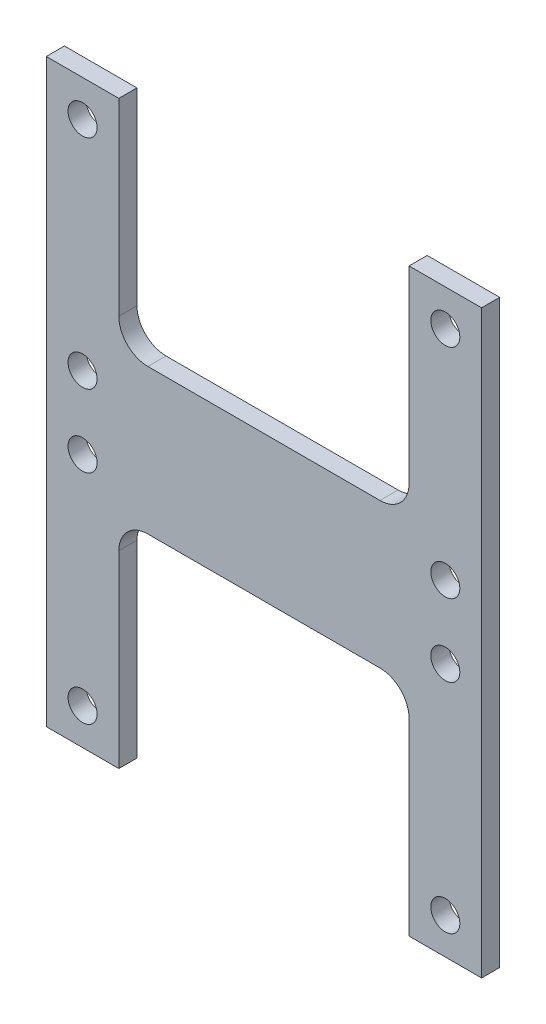
ISO-10303-21;
HEADER;
FILE_DESCRIPTION(('STEP AP214'),'2;1');
FILE_NAME('part.step','',(''),(''),'','','');
FILE_SCHEMA(('AUTOMOTIVE_DESIGN { 1 0 10303 214 1 1 1 1 }'));
ENDSEC;
DATA;
#1=APPLICATION_CONTEXT('core data for automotive mechanical design processes');
#2=APPLICATION_PROTOCOL_DEFINITION('international standard','automotive_design',2000,#1);
#3=PRODUCT_CONTEXT('',#1,'mechanical');
#4=PRODUCT('Part','Part','',(#3));
#5=PRODUCT_RELATED_PRODUCT_CATEGORY('part','',(#4));
#6=PRODUCT_DEFINITION_FORMATION('','',#4);
#7=PRODUCT_DEFINITION_CONTEXT('part definition',#1,'design');
#8=PRODUCT_DEFINITION('design','',#6,#7);
#9=PRODUCT_DEFINITION_SHAPE('','',#8);
#10=(LENGTH_UNIT() NAMED_UNIT(*) SI_UNIT(.MILLI.,.METRE.));
#11=(NAMED_UNIT(*) PLANE_ANGLE_UNIT() SI_UNIT($,.RADIAN.));
#12=(NAMED_UNIT(*) SI_UNIT($,.STERADIAN.) SOLID_ANGLE_UNIT());
#13=UNCERTAINTY_MEASURE_WITH_UNIT(LENGTH_MEASURE(1.E-05),#10,'distance_accuracy_value','');
#14=(GEOMETRIC_REPRESENTATION_CONTEXT(3) GLOBAL_UNCERTAINTY_ASSIGNED_CONTEXT((#13)) GLOBAL_UNIT_ASSIGNED_CONTEXT((#10,
#11,#12)) REPRESENTATION_CONTEXT('',''));
#15=CARTESIAN_POINT('',(0.,0.,0.));
#16=DIRECTION('',(0.,0.,1.));
#17=DIRECTION('',(1.,0.,0.));
#18=AXIS2_PLACEMENT_3D('',#15,#16,#17);
#19=CARTESIAN_POINT('',(0.,50.8,3.175));
#20=DIRECTION('',(0.,1.,0.));
#21=DIRECTION('',(0.,0.,1.));
#22=AXIS2_PLACEMENT_3D('',#19,#20,#21);
#23=PLANE('',#22);
#24=DIRECTION('',(1.,0.,0.));
#25=VECTOR('',#24,1.);
#26=CARTESIAN_POINT('',(0.,50.8,0.));
#27=LINE('',#26,#25);
#28=CARTESIAN_POINT('',(25.4,50.8,0.));
#29=VERTEX_POINT('',#28);
#30=CARTESIAN_POINT('',(38.1,50.8,0.));
#31=VERTEX_POINT('',#30);
#32=EDGE_CURVE('E176',#29,#31,#27,.T.);
#33=ORIENTED_EDGE('',*,*,#32,.F.);
#34=DIRECTION('',(0.,0.,-1.));
#35=VECTOR('',#34,1.);
#36=CARTESIAN_POINT('',(25.4,50.8,3.175));
#37=LINE('',#36,#35);
#38=CARTESIAN_POINT('',(25.4,50.8,3.175));
#39=VERTEX_POINT('',#38);
#40=EDGE_CURVE('E162',#39,#29,#37,.T.);
#41=ORIENTED_EDGE('',*,*,#40,.F.);
#42=DIRECTION('',(1.,0.,0.));
#43=VECTOR('',#42,1.);
#44=CARTESIAN_POINT('',(0.,50.8,3.175));
#45=LINE('',#44,#43);
#46=CARTESIAN_POINT('',(38.1,50.8,3.175));
#47=VERTEX_POINT('',#46);
#48=EDGE_CURVE('E170',#39,#47,#45,.T.);
#49=ORIENTED_EDGE('',*,*,#48,.T.);
#50=DIRECTION('',(0.,0.,-1.));
#51=VECTOR('',#50,1.);
#52=CARTESIAN_POINT('',(38.1,50.8,3.175));
#53=LINE('',#52,#51);
#54=EDGE_CURVE('E227',#47,#31,#53,.T.);
#55=ORIENTED_EDGE('',*,*,#54,.T.);
#56=EDGE_LOOP('',(#33,#41,#49,#55));
#57=FACE_BOUND('',#56,.T.);
#58=ADVANCED_FACE('F44',(#57),#23,.T.);
#59=CARTESIAN_POINT('',(25.4,0.,3.175));
#60=DIRECTION('',(-1.,0.,0.));
#61=DIRECTION('',(0.,0.,1.));
#62=AXIS2_PLACEMENT_3D('',#59,#60,#61);
#63=PLANE('',#62);
#64=DIRECTION('',(0.,1.,0.));
#65=VECTOR('',#64,1.);
#66=CARTESIAN_POINT('',(25.4,0.,0.));
#67=LINE('',#66,#65);
#68=CARTESIAN_POINT('',(25.4,17.78,0.));
#69=VERTEX_POINT('',#68);
#70=EDGE_CURVE('E230',#69,#29,#67,.T.);
#71=ORIENTED_EDGE('',*,*,#70,.F.);
#72=DIRECTION('',(0.,0.,-1.));
#73=VECTOR('',#72,1.);
#74=CARTESIAN_POINT('',(25.4,17.78,3.175));
#75=LINE('',#74,#73);
#76=CARTESIAN_POINT('',(25.4,17.78,3.175));
#77=VERTEX_POINT('',#76);
#78=EDGE_CURVE('E165',#69,#77,#75,.F.);
#79=ORIENTED_EDGE('',*,*,#78,.T.);
#80=DIRECTION('',(0.,1.,0.));
#81=VECTOR('',#80,1.);
#82=CARTESIAN_POINT('',(25.4,0.,3.175));
#83=LINE('',#82,#81);
#84=EDGE_CURVE('E158',#77,#39,#83,.T.);
#85=ORIENTED_EDGE('',*,*,#84,.T.);
#86=ORIENTED_EDGE('',*,*,#40,.T.);
#87=EDGE_LOOP('',(#71,#79,#85,#86));
#88=FACE_BOUND('',#87,.T.);
#89=ADVANCED_FACE('F161',(#88),#63,.T.);
#90=CARTESIAN_POINT('',(0.,12.7,3.175));
#91=DIRECTION('',(0.,1.,0.));
#92=DIRECTION('',(0.,0.,1.));
#93=AXIS2_PLACEMENT_3D('',#90,#91,#92);
#94=PLANE('',#93);
#95=DIRECTION('',(1.,0.,0.));
#96=VECTOR('',#95,1.);
#97=CARTESIAN_POINT('',(0.,12.7,3.175));
#98=LINE('',#97,#96);
#99=CARTESIAN_POINT('',(-20.32,12.7,3.175));
#100=VERTEX_POINT('',#99);
#101=CARTESIAN_POINT('',(20.32,12.7,3.175));
#102=VERTEX_POINT('',#101);
#103=EDGE_CURVE('E169',#100,#102,#98,.T.);
#104=ORIENTED_EDGE('',*,*,#103,.T.);
#105=DIRECTION('',(0.,0.,-1.));
#106=VECTOR('',#105,1.);
#107=CARTESIAN_POINT('',(20.32,12.7,0.));
#108=LINE('',#107,#106);
#109=CARTESIAN_POINT('',(20.32,12.7,0.));
#110=VERTEX_POINT('',#109);
#111=EDGE_CURVE('E304',#102,#110,#108,.T.);
#112=ORIENTED_EDGE('',*,*,#111,.T.);
#113=DIRECTION('',(1.,0.,0.));
#114=VECTOR('',#113,1.);
#115=CARTESIAN_POINT('',(0.,12.7,0.));
#116=LINE('',#115,#114);
#117=CARTESIAN_POINT('',(-20.32,12.7,0.));
#118=VERTEX_POINT('',#117);
#119=EDGE_CURVE('E234',#118,#110,#116,.T.);
#120=ORIENTED_EDGE('',*,*,#119,.F.);
#121=DIRECTION('',(0.,0.,-1.));
#122=VECTOR('',#121,1.);
#123=CARTESIAN_POINT('',(-20.32,12.7,3.175));
#124=LINE('',#123,#122);
#125=EDGE_CURVE('E301',#118,#100,#124,.F.);
#126=ORIENTED_EDGE('',*,*,#125,.T.);
#127=EDGE_LOOP('',(#104,#112,#120,#126));
#128=FACE_BOUND('',#127,.T.);
#129=ADVANCED_FACE('F336',(#128),#94,.T.);
#130=CARTESIAN_POINT('',(-25.4,0.,3.175));
#131=DIRECTION('',(1.,0.,0.));
#132=DIRECTION('',(0.,1.,0.));
#133=AXIS2_PLACEMENT_3D('',#130,#131,#132);
#134=PLANE('',#133);
#135=DIRECTION('',(0.,-1.,0.));
#136=VECTOR('',#135,1.);
#137=CARTESIAN_POINT('',(-25.4,0.,3.175));
#138=LINE('',#137,#136);
#139=CARTESIAN_POINT('',(-25.4,50.8,3.175));
#140=VERTEX_POINT('',#139);
#141=CARTESIAN_POINT('',(-25.4,17.78,3.175));
#142=VERTEX_POINT('',#141);
#143=EDGE_CURVE('E198',#140,#142,#138,.T.);
#144=ORIENTED_EDGE('',*,*,#143,.T.);
#145=DIRECTION('',(0.,0.,-1.));
#146=VECTOR('',#145,1.);
#147=CARTESIAN_POINT('',(-25.4,17.78,0.));
#148=LINE('',#147,#146);
#149=CARTESIAN_POINT('',(-25.4,17.78,0.));
#150=VERTEX_POINT('',#149);
#151=EDGE_CURVE('E310',#142,#150,#148,.T.);
#152=ORIENTED_EDGE('',*,*,#151,.T.);
#153=DIRECTION('',(0.,-1.,0.));
#154=VECTOR('',#153,1.);
#155=CARTESIAN_POINT('',(-25.4,0.,0.));
#156=LINE('',#155,#154);
#157=CARTESIAN_POINT('',(-25.4,50.8,0.));
#158=VERTEX_POINT('',#157);
#159=EDGE_CURVE('E238',#158,#150,#156,.T.);
#160=ORIENTED_EDGE('',*,*,#159,.F.);
#161=DIRECTION('',(0.,0.,-1.));
#162=VECTOR('',#161,1.);
#163=CARTESIAN_POINT('',(-25.4,50.8,3.175));
#164=LINE('',#163,#162);
#165=EDGE_CURVE('E179',#140,#158,#164,.T.);
#166=ORIENTED_EDGE('',*,*,#165,.F.);
#167=EDGE_LOOP('',(#144,#152,#160,#166));
#168=FACE_BOUND('',#167,.T.);
#169=ADVANCED_FACE('F339',(#168),#134,.T.);
#170=CARTESIAN_POINT('',(0.,50.8,3.175));
#171=DIRECTION('',(0.,1.,0.));
#172=DIRECTION('',(0.,0.,1.));
#173=AXIS2_PLACEMENT_3D('',#170,#171,#172);
#174=PLANE('',#173);
#175=DIRECTION('',(1.,0.,0.));
#176=VECTOR('',#175,1.);
#177=CARTESIAN_POINT('',(0.,50.8,0.));
#178=LINE('',#177,#176);
#179=CARTESIAN_POINT('',(-38.1,50.8,0.));
#180=VERTEX_POINT('',#179);
#181=EDGE_CURVE('E242',#180,#158,#178,.T.);
#182=ORIENTED_EDGE('',*,*,#181,.F.);
#183=DIRECTION('',(0.,0.,-1.));
#184=VECTOR('',#183,1.);
#185=CARTESIAN_POINT('',(-38.1,50.8,3.175));
#186=LINE('',#185,#184);
#187=CARTESIAN_POINT('',(-38.1,50.8,3.175));
#188=VERTEX_POINT('',#187);
#189=EDGE_CURVE('E283',#188,#180,#186,.T.);
#190=ORIENTED_EDGE('',*,*,#189,.F.);
#191=DIRECTION('',(1.,0.,0.));
#192=VECTOR('',#191,1.);
#193=CARTESIAN_POINT('',(0.,50.8,3.175));
#194=LINE('',#193,#192);
#195=EDGE_CURVE('E201',#188,#140,#194,.T.);
#196=ORIENTED_EDGE('',*,*,#195,.T.);
#197=ORIENTED_EDGE('',*,*,#165,.T.);
#198=EDGE_LOOP('',(#182,#190,#196,#197));
#199=FACE_BOUND('',#198,.T.);
#200=ADVANCED_FACE('F343',(#199),#174,.T.);
#201=CARTESIAN_POINT('',(-38.1,0.,3.175));
#202=DIRECTION('',(1.,0.,0.));
#203=DIRECTION('',(0.,1.,0.));
#204=AXIS2_PLACEMENT_3D('',#201,#202,#203);
#205=PLANE('',#204);
#206=DIRECTION('',(0.,-1.,0.));
#207=VECTOR('',#206,1.);
#208=CARTESIAN_POINT('',(-38.1,0.,0.));
#209=LINE('',#208,#207);
#210=CARTESIAN_POINT('',(-38.1,-50.8,0.));
#211=VERTEX_POINT('',#210);
#212=EDGE_CURVE('E246',#180,#211,#209,.T.);
#213=ORIENTED_EDGE('',*,*,#212,.T.);
#214=DIRECTION('',(0.,0.,-1.));
#215=VECTOR('',#214,1.);
#216=CARTESIAN_POINT('',(-38.1,-50.8,3.175));
#217=LINE('',#216,#215);
#218=CARTESIAN_POINT('',(-38.1,-50.8,3.175));
#219=VERTEX_POINT('',#218);
#220=EDGE_CURVE('E279',#219,#211,#217,.T.);
#221=ORIENTED_EDGE('',*,*,#220,.F.);
#222=DIRECTION('',(0.,-1.,0.));
#223=VECTOR('',#222,1.);
#224=CARTESIAN_POINT('',(-38.1,0.,3.175));
#225=LINE('',#224,#223);
#226=EDGE_CURVE('E205',#188,#219,#225,.T.);
#227=ORIENTED_EDGE('',*,*,#226,.F.);
#228=ORIENTED_EDGE('',*,*,#189,.T.);
#229=EDGE_LOOP('',(#213,#221,#227,#228));
#230=FACE_BOUND('',#229,.T.);
#231=ADVANCED_FACE('F348',(#230),#205,.F.);
#232=CARTESIAN_POINT('',(0.,-50.8,3.175));
#233=DIRECTION('',(0.,1.,0.));
#234=DIRECTION('',(0.,0.,1.));
#235=AXIS2_PLACEMENT_3D('',#232,#233,#234);
#236=PLANE('',#235);
#237=DIRECTION('',(1.,0.,0.));
#238=VECTOR('',#237,1.);
#239=CARTESIAN_POINT('',(0.,-50.8,0.));
#240=LINE('',#239,#238);
#241=CARTESIAN_POINT('',(-25.4,-50.8,0.));
#242=VERTEX_POINT('',#241);
#243=EDGE_CURVE('E249',#211,#242,#240,.T.);
#244=ORIENTED_EDGE('',*,*,#243,.T.);
#245=DIRECTION('',(0.,0.,-1.));
#246=VECTOR('',#245,1.);
#247=CARTESIAN_POINT('',(-25.4,-50.8,3.175));
#248=LINE('',#247,#246);
#249=CARTESIAN_POINT('',(-25.4,-50.8,3.175));
#250=VERTEX_POINT('',#249);
#251=EDGE_CURVE('E275',#250,#242,#248,.T.);
#252=ORIENTED_EDGE('',*,*,#251,.F.);
#253=DIRECTION('',(1.,0.,0.));
#254=VECTOR('',#253,1.);
#255=CARTESIAN_POINT('',(0.,-50.8,3.175));
#256=LINE('',#255,#254);
#257=EDGE_CURVE('E208',#219,#250,#256,.T.);
#258=ORIENTED_EDGE('',*,*,#257,.F.);
#259=ORIENTED_EDGE('',*,*,#220,.T.);
#260=EDGE_LOOP('',(#244,#252,#258,#259));
#261=FACE_BOUND('',#260,.T.);
#262=ADVANCED_FACE('F354',(#261),#236,.F.);
#263=CARTESIAN_POINT('',(-25.4,0.,3.175));
#264=DIRECTION('',(-1.,0.,0.));
#265=DIRECTION('',(0.,0.,1.));
#266=AXIS2_PLACEMENT_3D('',#263,#264,#265);
#267=PLANE('',#266);
#268=DIRECTION('',(0.,1.,0.));
#269=VECTOR('',#268,1.);
#270=CARTESIAN_POINT('',(-25.4,0.,0.));
#271=LINE('',#270,#269);
#272=CARTESIAN_POINT('',(-25.4,-17.7800000000001,0.));
#273=VERTEX_POINT('',#272);
#274=EDGE_CURVE('E252',#242,#273,#271,.T.);
#275=ORIENTED_EDGE('',*,*,#274,.T.);
#276=DIRECTION('',(0.,0.,-1.));
#277=VECTOR('',#276,1.);
#278=CARTESIAN_POINT('',(-25.4,-17.7800000000001,3.175));
#279=LINE('',#278,#277);
#280=CARTESIAN_POINT('',(-25.4,-17.7800000000001,3.175));
#281=VERTEX_POINT('',#280);
#282=EDGE_CURVE('E294',#273,#281,#279,.F.);
#283=ORIENTED_EDGE('',*,*,#282,.T.);
#284=DIRECTION('',(0.,1.,0.));
#285=VECTOR('',#284,1.);
#286=CARTESIAN_POINT('',(-25.4,0.,3.175));
#287=LINE('',#286,#285);
#288=EDGE_CURVE('E211',#250,#281,#287,.T.);
#289=ORIENTED_EDGE('',*,*,#288,.F.);
#290=ORIENTED_EDGE('',*,*,#251,.T.);
#291=EDGE_LOOP('',(#275,#283,#289,#290));
#292=FACE_BOUND('',#291,.T.);
#293=ADVANCED_FACE('F358',(#292),#267,.F.);
#294=CARTESIAN_POINT('',(0.,-12.7000000000001,3.175));
#295=DIRECTION('',(0.,1.,0.));
#296=DIRECTION('',(0.,0.,1.));
#297=AXIS2_PLACEMENT_3D('',#294,#295,#296);
#298=PLANE('',#297);
#299=DIRECTION('',(1.,0.,0.));
#300=VECTOR('',#299,1.);
#301=CARTESIAN_POINT('',(0.,-12.7000000000001,3.175));
#302=LINE('',#301,#300);
#303=CARTESIAN_POINT('',(-20.32,-12.7000000000001,3.175));
#304=VERTEX_POINT('',#303);
#305=CARTESIAN_POINT('',(20.32,-12.7000000000001,3.175));
#306=VERTEX_POINT('',#305);
#307=EDGE_CURVE('E215',#304,#306,#302,.T.);
#308=ORIENTED_EDGE('',*,*,#307,.F.);
#309=DIRECTION('',(0.,0.,-1.));
#310=VECTOR('',#309,1.);
#311=CARTESIAN_POINT('',(-20.32,-12.7000000000001,0.));
#312=LINE('',#311,#310);
#313=CARTESIAN_POINT('',(-20.32,-12.7000000000001,0.));
#314=VERTEX_POINT('',#313);
#315=EDGE_CURVE('E290',#304,#314,#312,.T.);
#316=ORIENTED_EDGE('',*,*,#315,.T.);
#317=DIRECTION('',(1.,0.,0.));
#318=VECTOR('',#317,1.);
#319=CARTESIAN_POINT('',(0.,-12.7000000000001,0.));
#320=LINE('',#319,#318);
#321=CARTESIAN_POINT('',(20.32,-12.7000000000001,0.));
#322=VERTEX_POINT('',#321);
#323=EDGE_CURVE('E256',#314,#322,#320,.T.);
#324=ORIENTED_EDGE('',*,*,#323,.T.);
#325=DIRECTION('',(0.,0.,-1.));
#326=VECTOR('',#325,1.);
#327=CARTESIAN_POINT('',(20.32,-12.7000000000001,3.175));
#328=LINE('',#327,#326);
#329=EDGE_CURVE('E178',#322,#306,#328,.F.);
#330=ORIENTED_EDGE('',*,*,#329,.T.);
#331=EDGE_LOOP('',(#308,#316,#324,#330));
#332=FACE_BOUND('',#331,.T.);
#333=ADVANCED_FACE('F366',(#332),#298,.F.);
#334=CARTESIAN_POINT('',(25.4,0.,3.175));
#335=DIRECTION('',(1.,0.,0.));
#336=DIRECTION('',(0.,1.,0.));
#337=AXIS2_PLACEMENT_3D('',#334,#335,#336);
#338=PLANE('',#337);
#339=DIRECTION('',(0.,-1.,0.));
#340=VECTOR('',#339,1.);
#341=CARTESIAN_POINT('',(25.4,0.,3.175));
#342=LINE('',#341,#340);
#343=CARTESIAN_POINT('',(25.4,-17.7800000000001,3.175));
#344=VERTEX_POINT('',#343);
#345=CARTESIAN_POINT('',(25.4,-50.8,3.175));
#346=VERTEX_POINT('',#345);
#347=EDGE_CURVE('E219',#344,#346,#342,.T.);
#348=ORIENTED_EDGE('',*,*,#347,.F.);
#349=DIRECTION('',(0.,0.,-1.));
#350=VECTOR('',#349,1.);
#351=CARTESIAN_POINT('',(25.4,-17.7800000000001,0.));
#352=LINE('',#351,#350);
#353=CARTESIAN_POINT('',(25.4,-17.7800000000001,0.));
#354=VERTEX_POINT('',#353);
#355=EDGE_CURVE('E297',#344,#354,#352,.T.);
#356=ORIENTED_EDGE('',*,*,#355,.T.);
#357=DIRECTION('',(0.,-1.,0.));
#358=VECTOR('',#357,1.);
#359=CARTESIAN_POINT('',(25.4,0.,0.));
#360=LINE('',#359,#358);
#361=CARTESIAN_POINT('',(25.4,-50.8,0.));
#362=VERTEX_POINT('',#361);
#363=EDGE_CURVE('E260',#354,#362,#360,.T.);
#364=ORIENTED_EDGE('',*,*,#363,.T.);
#365=DIRECTION('',(0.,0.,-1.));
#366=VECTOR('',#365,1.);
#367=CARTESIAN_POINT('',(25.4,-50.8,3.175));
#368=LINE('',#367,#366);
#369=EDGE_CURVE('E271',#346,#362,#368,.T.);
#370=ORIENTED_EDGE('',*,*,#369,.F.);
#371=EDGE_LOOP('',(#348,#356,#364,#370));
#372=FACE_BOUND('',#371,.T.);
#373=ADVANCED_FACE('F375',(#372),#338,.F.);
#374=CARTESIAN_POINT('',(0.,-50.8,3.175));
#375=DIRECTION('',(0.,1.,0.));
#376=DIRECTION('',(0.,0.,1.));
#377=AXIS2_PLACEMENT_3D('',#374,#375,#376);
#378=PLANE('',#377);
#379=DIRECTION('',(1.,0.,0.));
#380=VECTOR('',#379,1.);
#381=CARTESIAN_POINT('',(0.,-50.8,0.));
#382=LINE('',#381,#380);
#383=CARTESIAN_POINT('',(38.1,-50.8,0.));
#384=VERTEX_POINT('',#383);
#385=EDGE_CURVE('E189',#362,#384,#382,.T.);
#386=ORIENTED_EDGE('',*,*,#385,.T.);
#387=DIRECTION('',(0.,0.,-1.));
#388=VECTOR('',#387,1.);
#389=CARTESIAN_POINT('',(38.1,-50.8,3.175));
#390=LINE('',#389,#388);
#391=CARTESIAN_POINT('',(38.1,-50.8,3.175));
#392=VERTEX_POINT('',#391);
#393=EDGE_CURVE('E268',#392,#384,#390,.T.);
#394=ORIENTED_EDGE('',*,*,#393,.F.);
#395=DIRECTION('',(1.,0.,0.));
#396=VECTOR('',#395,1.);
#397=CARTESIAN_POINT('',(0.,-50.8,3.175));
#398=LINE('',#397,#396);
#399=EDGE_CURVE('E222',#346,#392,#398,.T.);
#400=ORIENTED_EDGE('',*,*,#399,.F.);
#401=ORIENTED_EDGE('',*,*,#369,.T.);
#402=EDGE_LOOP('',(#386,#394,#400,#401));
#403=FACE_BOUND('',#402,.T.);
#404=ADVANCED_FACE('F381',(#403),#378,.F.);
#405=CARTESIAN_POINT('',(38.1,0.,3.175));
#406=DIRECTION('',(1.,0.,0.));
#407=DIRECTION('',(0.,1.,0.));
#408=AXIS2_PLACEMENT_3D('',#405,#406,#407);
#409=PLANE('',#408);
#410=DIRECTION('',(0.,-1.,0.));
#411=VECTOR('',#410,1.);
#412=CARTESIAN_POINT('',(38.1,0.,0.));
#413=LINE('',#412,#411);
#414=EDGE_CURVE('E185',#31,#384,#413,.T.);
#415=ORIENTED_EDGE('',*,*,#414,.F.);
#416=ORIENTED_EDGE('',*,*,#54,.F.);
#417=DIRECTION('',(0.,-1.,0.));
#418=VECTOR('',#417,1.);
#419=CARTESIAN_POINT('',(38.1,0.,3.175));
#420=LINE('',#419,#418);
#421=EDGE_CURVE('E183',#47,#392,#420,.T.);
#422=ORIENTED_EDGE('',*,*,#421,.T.);
#423=ORIENTED_EDGE('',*,*,#393,.T.);
#424=EDGE_LOOP('',(#415,#416,#422,#423));
#425=FACE_BOUND('',#424,.T.);
#426=ADVANCED_FACE('F384',(#425),#409,.T.);
#427=CARTESIAN_POINT('',(0.,0.,3.175));
#428=DIRECTION('',(0.,0.,1.));
#429=DIRECTION('',(1.,0.,0.));
#430=AXIS2_PLACEMENT_3D('',#427,#428,#429);
#431=PLANE('',#430);
#432=CARTESIAN_POINT('',(-31.75,-6.35000000000004,3.175));
#433=DIRECTION('',(0.,0.,1.));
#434=DIRECTION('',(-1.,0.,0.));
#435=AXIS2_PLACEMENT_3D('',#432,#433,#434);
#436=CIRCLE('',#435,2.54);
#437=CARTESIAN_POINT('',(-34.29,-6.35000000000004,3.175));
#438=VERTEX_POINT('',#437);
#439=EDGE_CURVE('E685',#438,#438,#436,.T.);
#440=ORIENTED_EDGE('',*,*,#439,.F.);
#441=EDGE_LOOP('',(#440));
#442=FACE_BOUND('',#441,.T.);
#443=CARTESIAN_POINT('',(31.75,44.45,3.175));
#444=DIRECTION('',(0.,0.,1.));
#445=DIRECTION('',(1.,0.,0.));
#446=AXIS2_PLACEMENT_3D('',#443,#444,#445);
#447=CIRCLE('',#446,2.54);
#448=CARTESIAN_POINT('',(34.29,44.45,3.175));
#449=VERTEX_POINT('',#448);
#450=EDGE_CURVE('E705',#449,#449,#447,.T.);
#451=ORIENTED_EDGE('',*,*,#450,.F.);
#452=EDGE_LOOP('',(#451));
#453=FACE_BOUND('',#452,.T.);
#454=CARTESIAN_POINT('',(31.75,6.34999999999999,3.175));
#455=DIRECTION('',(0.,0.,1.));
#456=DIRECTION('',(1.,0.,0.));
#457=AXIS2_PLACEMENT_3D('',#454,#455,#456);
#458=CIRCLE('',#457,2.54);
#459=CARTESIAN_POINT('',(34.29,6.34999999999999,3.175));
#460=VERTEX_POINT('',#459);
#461=EDGE_CURVE('E725',#460,#460,#458,.T.);
#462=ORIENTED_EDGE('',*,*,#461,.F.);
#463=EDGE_LOOP('',(#462));
#464=FACE_BOUND('',#463,.T.);
#465=CARTESIAN_POINT('',(-31.75,6.34999999999999,3.175));
#466=DIRECTION('',(0.,0.,1.));
#467=DIRECTION('',(1.,0.,0.));
#468=AXIS2_PLACEMENT_3D('',#465,#466,#467);
#469=CIRCLE('',#468,2.54);
#470=CARTESIAN_POINT('',(-29.21,6.34999999999999,3.175));
#471=VERTEX_POINT('',#470);
#472=EDGE_CURVE('E717',#471,#471,#469,.T.);
#473=ORIENTED_EDGE('',*,*,#472,.F.);
#474=EDGE_LOOP('',(#473));
#475=FACE_BOUND('',#474,.T.);
#476=CARTESIAN_POINT('',(31.7499999999999,-6.35000000000004,3.175));
#477=DIRECTION('',(0.,0.,1.));
#478=DIRECTION('',(-1.,0.,0.));
#479=AXIS2_PLACEMENT_3D('',#476,#477,#478);
#480=CIRCLE('',#479,2.54);
#481=CARTESIAN_POINT('',(29.2099999999999,-6.35000000000004,3.175));
#482=VERTEX_POINT('',#481);
#483=EDGE_CURVE('E677',#482,#482,#480,.T.);
#484=ORIENTED_EDGE('',*,*,#483,.F.);
#485=EDGE_LOOP('',(#484));
#486=FACE_BOUND('',#485,.T.);
#487=CARTESIAN_POINT('',(31.7499999999999,-44.45,3.175));
#488=DIRECTION('',(0.,0.,1.));
#489=DIRECTION('',(-1.,0.,0.));
#490=AXIS2_PLACEMENT_3D('',#487,#488,#489);
#491=CIRCLE('',#490,2.54);
#492=CARTESIAN_POINT('',(29.2099999999999,-44.45,3.175));
#493=VERTEX_POINT('',#492);
#494=EDGE_CURVE('E687',#493,#493,#491,.T.);
#495=ORIENTED_EDGE('',*,*,#494,.F.);
#496=EDGE_LOOP('',(#495));
#497=FACE_BOUND('',#496,.T.);
#498=CARTESIAN_POINT('',(-31.75,-44.45,3.175));
#499=DIRECTION('',(0.,0.,1.));
#500=DIRECTION('',(-1.,0.,0.));
#501=AXIS2_PLACEMENT_3D('',#498,#499,#500);
#502=CIRCLE('',#501,2.54);
#503=CARTESIAN_POINT('',(-34.29,-44.45,3.175));
#504=VERTEX_POINT('',#503);
#505=EDGE_CURVE('E697',#504,#504,#502,.T.);
#506=ORIENTED_EDGE('',*,*,#505,.F.);
#507=EDGE_LOOP('',(#506));
#508=FACE_BOUND('',#507,.T.);
#509=CARTESIAN_POINT('',(-31.75,44.45,3.175));
#510=DIRECTION('',(0.,0.,1.));
#511=DIRECTION('',(1.,0.,0.));
#512=AXIS2_PLACEMENT_3D('',#509,#510,#511);
#513=CIRCLE('',#512,2.54);
#514=CARTESIAN_POINT('',(-29.21,44.45,3.175));
#515=VERTEX_POINT('',#514);
#516=EDGE_CURVE('E192',#515,#515,#513,.T.);
#517=ORIENTED_EDGE('',*,*,#516,.F.);
#518=EDGE_LOOP('',(#517));
#519=FACE_BOUND('',#518,.T.);
#520=ORIENTED_EDGE('',*,*,#48,.F.);
#521=ORIENTED_EDGE('',*,*,#84,.F.);
#522=CARTESIAN_POINT('',(20.32,17.78,3.175));
#523=DIRECTION('',(0.,0.,1.));
#524=DIRECTION('',(1.,0.,0.));
#525=AXIS2_PLACEMENT_3D('',#522,#523,#524);
#526=CIRCLE('',#525,5.08);
#527=EDGE_CURVE('E328',#77,#102,#526,.F.);
#528=ORIENTED_EDGE('',*,*,#527,.T.);
#529=ORIENTED_EDGE('',*,*,#103,.F.);
#530=CARTESIAN_POINT('',(-20.32,17.78,3.175));
#531=DIRECTION('',(0.,0.,1.));
#532=DIRECTION('',(1.,0.,0.));
#533=AXIS2_PLACEMENT_3D('',#530,#531,#532);
#534=CIRCLE('',#533,5.08);
#535=EDGE_CURVE('E11',#100,#142,#534,.F.);
#536=ORIENTED_EDGE('',*,*,#535,.T.);
#537=ORIENTED_EDGE('',*,*,#143,.F.);
#538=ORIENTED_EDGE('',*,*,#195,.F.);
#539=ORIENTED_EDGE('',*,*,#226,.T.);
#540=ORIENTED_EDGE('',*,*,#257,.T.);
#541=ORIENTED_EDGE('',*,*,#288,.T.);
#542=CARTESIAN_POINT('',(-20.32,-17.7800000000001,3.175));
#543=DIRECTION('',(0.,0.,1.));
#544=DIRECTION('',(1.,0.,0.));
#545=AXIS2_PLACEMENT_3D('',#542,#543,#544);
#546=CIRCLE('',#545,5.08);
#547=EDGE_CURVE('E316',#281,#304,#546,.F.);
#548=ORIENTED_EDGE('',*,*,#547,.T.);
#549=ORIENTED_EDGE('',*,*,#307,.T.);
#550=CARTESIAN_POINT('',(20.32,-17.7800000000001,3.175));
#551=DIRECTION('',(0.,0.,1.));
#552=DIRECTION('',(1.,0.,0.));
#553=AXIS2_PLACEMENT_3D('',#550,#551,#552);
#554=CIRCLE('',#553,5.08);
#555=EDGE_CURVE('E322',#306,#344,#554,.F.);
#556=ORIENTED_EDGE('',*,*,#555,.T.);
#557=ORIENTED_EDGE('',*,*,#347,.T.);
#558=ORIENTED_EDGE('',*,*,#399,.T.);
#559=ORIENTED_EDGE('',*,*,#421,.F.);
#560=EDGE_LOOP('',(#520,#521,#528,#529,#536,#537,#538,#539,#540,#541,#548,#549,#556,#557,#558,#559));
#561=FACE_BOUND('',#560,.T.);
#562=ADVANCED_FACE('F181',(#442,#453,#464,#475,#486,#497,#508,#519,#561),#431,.T.);
#563=CARTESIAN_POINT('',(0.,0.,0.));
#564=DIRECTION('',(0.,0.,1.));
#565=DIRECTION('',(1.,0.,0.));
#566=AXIS2_PLACEMENT_3D('',#563,#564,#565);
#567=PLANE('',#566);
#568=CARTESIAN_POINT('',(-31.75,-6.35000000000004,0.));
#569=DIRECTION('',(0.,0.,1.));
#570=DIRECTION('',(-1.,0.,0.));
#571=AXIS2_PLACEMENT_3D('',#568,#569,#570);
#572=CIRCLE('',#571,2.54);
#573=CARTESIAN_POINT('',(-34.29,-6.35000000000004,0.));
#574=VERTEX_POINT('',#573);
#575=EDGE_CURVE('E680',#574,#574,#572,.T.);
#576=ORIENTED_EDGE('',*,*,#575,.T.);
#577=EDGE_LOOP('',(#576));
#578=FACE_BOUND('',#577,.T.);
#579=CARTESIAN_POINT('',(31.75,44.45,0.));
#580=DIRECTION('',(0.,0.,1.));
#581=DIRECTION('',(1.,0.,0.));
#582=AXIS2_PLACEMENT_3D('',#579,#580,#581);
#583=CIRCLE('',#582,2.54);
#584=CARTESIAN_POINT('',(34.29,44.45,0.));
#585=VERTEX_POINT('',#584);
#586=EDGE_CURVE('E710',#585,#585,#583,.T.);
#587=ORIENTED_EDGE('',*,*,#586,.T.);
#588=EDGE_LOOP('',(#587));
#589=FACE_BOUND('',#588,.T.);
#590=CARTESIAN_POINT('',(31.75,6.34999999999999,0.));
#591=DIRECTION('',(0.,0.,1.));
#592=DIRECTION('',(1.,0.,0.));
#593=AXIS2_PLACEMENT_3D('',#590,#591,#592);
#594=CIRCLE('',#593,2.54);
#595=CARTESIAN_POINT('',(34.29,6.34999999999999,0.));
#596=VERTEX_POINT('',#595);
#597=EDGE_CURVE('E709',#596,#596,#594,.T.);
#598=ORIENTED_EDGE('',*,*,#597,.T.);
#599=EDGE_LOOP('',(#598));
#600=FACE_BOUND('',#599,.T.);
#601=CARTESIAN_POINT('',(-31.75,6.34999999999999,0.));
#602=DIRECTION('',(0.,0.,1.));
#603=DIRECTION('',(1.,0.,0.));
#604=AXIS2_PLACEMENT_3D('',#601,#602,#603);
#605=CIRCLE('',#604,2.54);
#606=CARTESIAN_POINT('',(-29.21,6.34999999999999,0.));
#607=VERTEX_POINT('',#606);
#608=EDGE_CURVE('E721',#607,#607,#605,.T.);
#609=ORIENTED_EDGE('',*,*,#608,.T.);
#610=EDGE_LOOP('',(#609));
#611=FACE_BOUND('',#610,.T.);
#612=CARTESIAN_POINT('',(31.7499999999999,-6.35000000000004,0.));
#613=DIRECTION('',(0.,0.,1.));
#614=DIRECTION('',(-1.,0.,0.));
#615=AXIS2_PLACEMENT_3D('',#612,#613,#614);
#616=CIRCLE('',#615,2.54);
#617=CARTESIAN_POINT('',(29.2099999999999,-6.35000000000004,0.));
#618=VERTEX_POINT('',#617);
#619=EDGE_CURVE('E674',#618,#618,#616,.T.);
#620=ORIENTED_EDGE('',*,*,#619,.T.);
#621=EDGE_LOOP('',(#620));
#622=FACE_BOUND('',#621,.T.);
#623=CARTESIAN_POINT('',(31.7499999999999,-44.45,0.));
#624=DIRECTION('',(0.,0.,1.));
#625=DIRECTION('',(-1.,0.,0.));
#626=AXIS2_PLACEMENT_3D('',#623,#624,#625);
#627=CIRCLE('',#626,2.54);
#628=CARTESIAN_POINT('',(29.2099999999999,-44.45,0.));
#629=VERTEX_POINT('',#628);
#630=EDGE_CURVE('E693',#629,#629,#627,.T.);
#631=ORIENTED_EDGE('',*,*,#630,.T.);
#632=EDGE_LOOP('',(#631));
#633=FACE_BOUND('',#632,.T.);
#634=CARTESIAN_POINT('',(-31.75,-44.45,0.));
#635=DIRECTION('',(0.,0.,1.));
#636=DIRECTION('',(-1.,0.,0.));
#637=AXIS2_PLACEMENT_3D('',#634,#635,#636);
#638=CIRCLE('',#637,2.54);
#639=CARTESIAN_POINT('',(-34.29,-44.45,0.));
#640=VERTEX_POINT('',#639);
#641=EDGE_CURVE('E701',#640,#640,#638,.T.);
#642=ORIENTED_EDGE('',*,*,#641,.T.);
#643=EDGE_LOOP('',(#642));
#644=FACE_BOUND('',#643,.T.);
#645=CARTESIAN_POINT('',(-31.75,44.45,0.));
#646=DIRECTION('',(0.,0.,1.));
#647=DIRECTION('',(1.,0.,0.));
#648=AXIS2_PLACEMENT_3D('',#645,#646,#647);
#649=CIRCLE('',#648,2.54);
#650=CARTESIAN_POINT('',(-29.21,44.45,0.));
#651=VERTEX_POINT('',#650);
#652=EDGE_CURVE('E231',#651,#651,#649,.T.);
#653=ORIENTED_EDGE('',*,*,#652,.T.);
#654=EDGE_LOOP('',(#653));
#655=FACE_BOUND('',#654,.T.);
#656=ORIENTED_EDGE('',*,*,#32,.T.);
#657=ORIENTED_EDGE('',*,*,#414,.T.);
#658=ORIENTED_EDGE('',*,*,#385,.F.);
#659=ORIENTED_EDGE('',*,*,#363,.F.);
#660=CARTESIAN_POINT('',(20.32,-17.7800000000001,0.));
#661=DIRECTION('',(0.,0.,1.));
#662=DIRECTION('',(1.,0.,0.));
#663=AXIS2_PLACEMENT_3D('',#660,#661,#662);
#664=CIRCLE('',#663,5.08);
#665=EDGE_CURVE('E319',#354,#322,#664,.T.);
#666=ORIENTED_EDGE('',*,*,#665,.T.);
#667=ORIENTED_EDGE('',*,*,#323,.F.);
#668=CARTESIAN_POINT('',(-20.32,-17.7800000000001,0.));
#669=DIRECTION('',(0.,0.,1.));
#670=DIRECTION('',(1.,0.,0.));
#671=AXIS2_PLACEMENT_3D('',#668,#669,#670);
#672=CIRCLE('',#671,5.08);
#673=EDGE_CURVE('E313',#314,#273,#672,.T.);
#674=ORIENTED_EDGE('',*,*,#673,.T.);
#675=ORIENTED_EDGE('',*,*,#274,.F.);
#676=ORIENTED_EDGE('',*,*,#243,.F.);
#677=ORIENTED_EDGE('',*,*,#212,.F.);
#678=ORIENTED_EDGE('',*,*,#181,.T.);
#679=ORIENTED_EDGE('',*,*,#159,.T.);
#680=CARTESIAN_POINT('',(-20.32,17.78,0.));
#681=DIRECTION('',(0.,0.,1.));
#682=DIRECTION('',(1.,0.,0.));
#683=AXIS2_PLACEMENT_3D('',#680,#681,#682);
#684=CIRCLE('',#683,5.08);
#685=EDGE_CURVE('E53',#150,#118,#684,.T.);
#686=ORIENTED_EDGE('',*,*,#685,.T.);
#687=ORIENTED_EDGE('',*,*,#119,.T.);
#688=CARTESIAN_POINT('',(20.32,17.78,0.));
#689=DIRECTION('',(0.,0.,1.));
#690=DIRECTION('',(1.,0.,0.));
#691=AXIS2_PLACEMENT_3D('',#688,#689,#690);
#692=CIRCLE('',#691,5.08);
#693=EDGE_CURVE('E325',#110,#69,#692,.T.);
#694=ORIENTED_EDGE('',*,*,#693,.T.);
#695=ORIENTED_EDGE('',*,*,#70,.T.);
#696=EDGE_LOOP('',(#656,#657,#658,#659,#666,#667,#674,#675,#676,#677,#678,#679,#686,#687,#694,#695));
#697=FACE_BOUND('',#696,.T.);
#698=ADVANCED_FACE('F333',(#578,#589,#600,#611,#622,#633,#644,#655,#697),#567,.F.);
#699=CARTESIAN_POINT('',(-31.75,44.45,0.));
#700=DIRECTION('',(0.,0.,1.));
#701=DIRECTION('',(1.,0.,0.));
#702=AXIS2_PLACEMENT_3D('',#699,#700,#701);
#703=CYLINDRICAL_SURFACE('',#702,2.54);
#704=ORIENTED_EDGE('',*,*,#652,.F.);
#705=EDGE_LOOP('',(#704));
#706=FACE_BOUND('',#705,.T.);
#707=ORIENTED_EDGE('',*,*,#516,.T.);
#708=EDGE_LOOP('',(#707));
#709=FACE_BOUND('',#708,.T.);
#710=ADVANCED_FACE('F427',(#706,#709),#703,.F.);
#711=CARTESIAN_POINT('',(-31.75,-44.45,0.));
#712=DIRECTION('',(0.,0.,1.));
#713=DIRECTION('',(1.,0.,0.));
#714=AXIS2_PLACEMENT_3D('',#711,#712,#713);
#715=CYLINDRICAL_SURFACE('',#714,2.54);
#716=ORIENTED_EDGE('',*,*,#641,.F.);
#717=EDGE_LOOP('',(#716));
#718=FACE_BOUND('',#717,.T.);
#719=ORIENTED_EDGE('',*,*,#505,.T.);
#720=EDGE_LOOP('',(#719));
#721=FACE_BOUND('',#720,.T.);
#722=ADVANCED_FACE('F430',(#718,#721),#715,.F.);
#723=CARTESIAN_POINT('',(31.7499999999999,-44.45,0.));
#724=DIRECTION('',(0.,0.,1.));
#725=DIRECTION('',(1.,0.,0.));
#726=AXIS2_PLACEMENT_3D('',#723,#724,#725);
#727=CYLINDRICAL_SURFACE('',#726,2.54);
#728=ORIENTED_EDGE('',*,*,#630,.F.);
#729=EDGE_LOOP('',(#728));
#730=FACE_BOUND('',#729,.T.);
#731=ORIENTED_EDGE('',*,*,#494,.T.);
#732=EDGE_LOOP('',(#731));
#733=FACE_BOUND('',#732,.T.);
#734=ADVANCED_FACE('F514',(#730,#733),#727,.F.);
#735=CARTESIAN_POINT('',(31.7499999999999,-6.35000000000004,0.));
#736=DIRECTION('',(0.,0.,1.));
#737=DIRECTION('',(1.,0.,0.));
#738=AXIS2_PLACEMENT_3D('',#735,#736,#737);
#739=CYLINDRICAL_SURFACE('',#738,2.54);
#740=ORIENTED_EDGE('',*,*,#619,.F.);
#741=EDGE_LOOP('',(#740));
#742=FACE_BOUND('',#741,.T.);
#743=ORIENTED_EDGE('',*,*,#483,.T.);
#744=EDGE_LOOP('',(#743));
#745=FACE_BOUND('',#744,.T.);
#746=ADVANCED_FACE('F422',(#742,#745),#739,.F.);
#747=CARTESIAN_POINT('',(-31.75,6.34999999999999,0.));
#748=DIRECTION('',(0.,0.,1.));
#749=DIRECTION('',(1.,0.,0.));
#750=AXIS2_PLACEMENT_3D('',#747,#748,#749);
#751=CYLINDRICAL_SURFACE('',#750,2.54);
#752=ORIENTED_EDGE('',*,*,#608,.F.);
#753=EDGE_LOOP('',(#752));
#754=FACE_BOUND('',#753,.T.);
#755=ORIENTED_EDGE('',*,*,#472,.T.);
#756=EDGE_LOOP('',(#755));
#757=FACE_BOUND('',#756,.T.);
#758=ADVANCED_FACE('F419',(#754,#757),#751,.F.);
#759=CARTESIAN_POINT('',(31.75,6.34999999999999,0.));
#760=DIRECTION('',(0.,0.,1.));
#761=DIRECTION('',(1.,0.,0.));
#762=AXIS2_PLACEMENT_3D('',#759,#760,#761);
#763=CYLINDRICAL_SURFACE('',#762,2.54);
#764=ORIENTED_EDGE('',*,*,#597,.F.);
#765=EDGE_LOOP('',(#764));
#766=FACE_BOUND('',#765,.T.);
#767=ORIENTED_EDGE('',*,*,#461,.T.);
#768=EDGE_LOOP('',(#767));
#769=FACE_BOUND('',#768,.T.);
#770=ADVANCED_FACE('F412',(#766,#769),#763,.F.);
#771=CARTESIAN_POINT('',(31.75,44.45,0.));
#772=DIRECTION('',(0.,0.,1.));
#773=DIRECTION('',(1.,0.,0.));
#774=AXIS2_PLACEMENT_3D('',#771,#772,#773);
#775=CYLINDRICAL_SURFACE('',#774,2.54);
#776=ORIENTED_EDGE('',*,*,#586,.F.);
#777=EDGE_LOOP('',(#776));
#778=FACE_BOUND('',#777,.T.);
#779=ORIENTED_EDGE('',*,*,#450,.T.);
#780=EDGE_LOOP('',(#779));
#781=FACE_BOUND('',#780,.T.);
#782=ADVANCED_FACE('F406',(#778,#781),#775,.F.);
#783=CARTESIAN_POINT('',(-31.75,-6.35000000000004,0.));
#784=DIRECTION('',(0.,0.,1.));
#785=DIRECTION('',(1.,0.,0.));
#786=AXIS2_PLACEMENT_3D('',#783,#784,#785);
#787=CYLINDRICAL_SURFACE('',#786,2.54);
#788=ORIENTED_EDGE('',*,*,#575,.F.);
#789=EDGE_LOOP('',(#788));
#790=FACE_BOUND('',#789,.T.);
#791=ORIENTED_EDGE('',*,*,#439,.T.);
#792=EDGE_LOOP('',(#791));
#793=FACE_BOUND('',#792,.T.);
#794=ADVANCED_FACE('F402',(#790,#793),#787,.F.);
#795=CARTESIAN_POINT('',(-20.32,-17.7800000000001,3.175));
#796=DIRECTION('',(0.,0.,1.));
#797=DIRECTION('',(1.,0.,0.));
#798=AXIS2_PLACEMENT_3D('',#795,#796,#797);
#799=CYLINDRICAL_SURFACE('',#798,5.08);
#800=ORIENTED_EDGE('',*,*,#547,.F.);
#801=ORIENTED_EDGE('',*,*,#282,.F.);
#802=ORIENTED_EDGE('',*,*,#673,.F.);
#803=ORIENTED_EDGE('',*,*,#315,.F.);
#804=EDGE_LOOP('',(#800,#801,#802,#803));
#805=FACE_BOUND('',#804,.T.);
#806=ADVANCED_FACE('F361',(#805),#799,.F.);
#807=CARTESIAN_POINT('',(20.32,-17.7800000000001,3.175));
#808=DIRECTION('',(0.,0.,1.));
#809=DIRECTION('',(1.,0.,0.));
#810=AXIS2_PLACEMENT_3D('',#807,#808,#809);
#811=CYLINDRICAL_SURFACE('',#810,5.08);
#812=ORIENTED_EDGE('',*,*,#555,.F.);
#813=ORIENTED_EDGE('',*,*,#329,.F.);
#814=ORIENTED_EDGE('',*,*,#665,.F.);
#815=ORIENTED_EDGE('',*,*,#355,.F.);
#816=EDGE_LOOP('',(#812,#813,#814,#815));
#817=FACE_BOUND('',#816,.T.);
#818=ADVANCED_FACE('F370',(#817),#811,.F.);
#819=CARTESIAN_POINT('',(20.32,17.78,3.175));
#820=DIRECTION('',(0.,0.,1.));
#821=DIRECTION('',(1.,0.,0.));
#822=AXIS2_PLACEMENT_3D('',#819,#820,#821);
#823=CYLINDRICAL_SURFACE('',#822,5.08);
#824=ORIENTED_EDGE('',*,*,#527,.F.);
#825=ORIENTED_EDGE('',*,*,#78,.F.);
#826=ORIENTED_EDGE('',*,*,#693,.F.);
#827=ORIENTED_EDGE('',*,*,#111,.F.);
#828=EDGE_LOOP('',(#824,#825,#826,#827));
#829=FACE_BOUND('',#828,.T.);
#830=ADVANCED_FACE('F386',(#829),#823,.F.);
#831=CARTESIAN_POINT('',(-20.32,17.78,3.175));
#832=DIRECTION('',(0.,0.,1.));
#833=DIRECTION('',(1.,0.,0.));
#834=AXIS2_PLACEMENT_3D('',#831,#832,#833);
#835=CYLINDRICAL_SURFACE('',#834,5.08);
#836=ORIENTED_EDGE('',*,*,#535,.F.);
#837=ORIENTED_EDGE('',*,*,#125,.F.);
#838=ORIENTED_EDGE('',*,*,#685,.F.);
#839=ORIENTED_EDGE('',*,*,#151,.F.);
#840=EDGE_LOOP('',(#836,#837,#838,#839));
#841=FACE_BOUND('',#840,.T.);
#842=ADVANCED_FACE('F46',(#841),#835,.F.);
#843=CLOSED_SHELL('',(#58,#89,#129,#169,#200,#231,#262,#293,#333,#373,#404,#426,#562,#698,#710,
#722,#734,#746,#758,#770,#782,#794,#806,#818,#830,#842));
#844=MANIFOLD_SOLID_BREP('B2',#843);
#845=ADVANCED_BREP_SHAPE_REPRESENTATION('',(#18,#844),#14);
#846=SHAPE_DEFINITION_REPRESENTATION(#9,#845);
ENDSEC;
END-ISO-10303-21;
